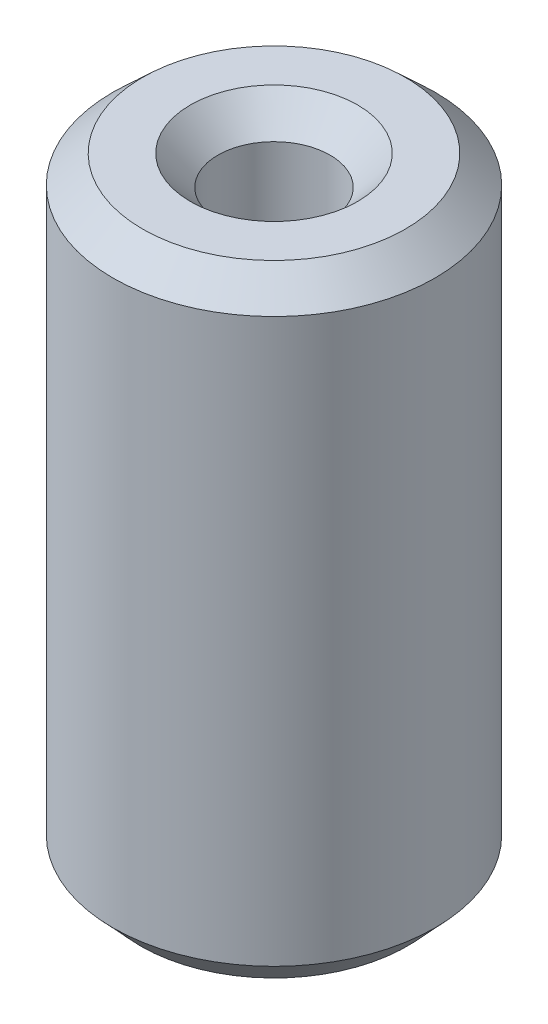
ISO-10303-21;
HEADER;
FILE_DESCRIPTION(('STEP AP214'),'2;1');
FILE_NAME('part.step','',(''),(''),'','','');
FILE_SCHEMA(('AUTOMOTIVE_DESIGN { 1 0 10303 214 1 1 1 1 }'));
ENDSEC;
DATA;
#1=APPLICATION_CONTEXT('core data for automotive mechanical design processes');
#2=APPLICATION_PROTOCOL_DEFINITION('international standard','automotive_design',2000,#1);
#3=PRODUCT_CONTEXT('',#1,'mechanical');
#4=PRODUCT('Part','Part','',(#3));
#5=PRODUCT_RELATED_PRODUCT_CATEGORY('part','',(#4));
#6=PRODUCT_DEFINITION_FORMATION('','',#4);
#7=PRODUCT_DEFINITION_CONTEXT('part definition',#1,'design');
#8=PRODUCT_DEFINITION('design','',#6,#7);
#9=PRODUCT_DEFINITION_SHAPE('','',#8);
#10=(LENGTH_UNIT() NAMED_UNIT(*) SI_UNIT(.MILLI.,.METRE.));
#11=(NAMED_UNIT(*) PLANE_ANGLE_UNIT() SI_UNIT($,.RADIAN.));
#12=(NAMED_UNIT(*) SI_UNIT($,.STERADIAN.) SOLID_ANGLE_UNIT());
#13=UNCERTAINTY_MEASURE_WITH_UNIT(LENGTH_MEASURE(1.E-05),#10,'distance_accuracy_value','');
#14=(GEOMETRIC_REPRESENTATION_CONTEXT(3) GLOBAL_UNCERTAINTY_ASSIGNED_CONTEXT((#13)) GLOBAL_UNIT_ASSIGNED_CONTEXT((#10,
#11,#12)) REPRESENTATION_CONTEXT('',''));
#15=CARTESIAN_POINT('',(0.,0.,0.));
#16=DIRECTION('',(0.,0.,1.));
#17=DIRECTION('',(1.,0.,0.));
#18=AXIS2_PLACEMENT_3D('',#15,#16,#17);
#19=CARTESIAN_POINT('',(0.,48.1296991277739,0.));
#20=DIRECTION('',(0.,-1.,0.));
#21=DIRECTION('',(0.,0.,-1.));
#22=AXIS2_PLACEMENT_3D('',#19,#20,#21);
#23=CYLINDRICAL_SURFACE('',#22,12.5);
#24=CARTESIAN_POINT('',(0.,2.29818482325118,0.));
#25=DIRECTION('',(0.,1.,0.));
#26=DIRECTION('',(0.,0.,1.));
#27=AXIS2_PLACEMENT_3D('',#24,#25,#26);
#28=CIRCLE('',#27,12.5);
#29=CARTESIAN_POINT('',(0.,2.29818482325118,12.5));
#30=VERTEX_POINT('',#29);
#31=EDGE_CURVE('E10',#30,#30,#28,.T.);
#32=ORIENTED_EDGE('',*,*,#31,.T.);
#33=EDGE_LOOP('',(#32));
#34=FACE_BOUND('',#33,.T.);
#35=CARTESIAN_POINT('',(0.,45.9868929971952,0.));
#36=DIRECTION('',(0.,1.,0.));
#37=DIRECTION('',(0.,0.,1.));
#38=AXIS2_PLACEMENT_3D('',#35,#36,#37);
#39=CIRCLE('',#38,12.5);
#40=CARTESIAN_POINT('',(0.,45.9868929971952,12.5));
#41=VERTEX_POINT('',#40);
#42=EDGE_CURVE('E50',#41,#41,#39,.F.);
#43=ORIENTED_EDGE('',*,*,#42,.T.);
#44=EDGE_LOOP('',(#43));
#45=FACE_BOUND('',#44,.T.);
#46=ADVANCED_FACE('F39',(#34,#45),#23,.T.);
#47=CARTESIAN_POINT('',(0.,48.1296991277739,0.));
#48=DIRECTION('',(0.,1.,0.));
#49=DIRECTION('',(0.,0.,1.));
#50=AXIS2_PLACEMENT_3D('',#47,#48,#49);
#51=PLANE('',#50);
#52=CARTESIAN_POINT('',(0.,48.1296991277739,0.));
#53=DIRECTION('',(0.,1.,0.));
#54=DIRECTION('',(0.,0.,1.));
#55=AXIS2_PLACEMENT_3D('',#52,#53,#54);
#56=CIRCLE('',#55,6.49425256324005);
#57=CARTESIAN_POINT('',(0.,48.1296991277739,6.49425256324005));
#58=VERTEX_POINT('',#57);
#59=EDGE_CURVE('E58',#58,#58,#56,.F.);
#60=ORIENTED_EDGE('',*,*,#59,.T.);
#61=EDGE_LOOP('',(#60));
#62=FACE_BOUND('',#61,.T.);
#63=CARTESIAN_POINT('',(0.,48.1296991277739,0.));
#64=DIRECTION('',(0.,1.,0.));
#65=DIRECTION('',(0.,0.,1.));
#66=AXIS2_PLACEMENT_3D('',#63,#64,#65);
#67=CIRCLE('',#66,10.2018151767488);
#68=CARTESIAN_POINT('',(0.,48.1296991277739,10.2018151767488));
#69=VERTEX_POINT('',#68);
#70=EDGE_CURVE('E61',#69,#69,#67,.T.);
#71=ORIENTED_EDGE('',*,*,#70,.T.);
#72=EDGE_LOOP('',(#71));
#73=FACE_BOUND('',#72,.T.);
#74=ADVANCED_FACE('F88',(#62,#73),#51,.T.);
#75=CARTESIAN_POINT('',(0.,0.,0.));
#76=DIRECTION('',(0.,1.,0.));
#77=DIRECTION('',(0.,0.,1.));
#78=AXIS2_PLACEMENT_3D('',#75,#76,#77);
#79=PLANE('',#78);
#80=CARTESIAN_POINT('',(0.,0.,0.));
#81=DIRECTION('',(0.,1.,0.));
#82=DIRECTION('',(0.,0.,1.));
#83=AXIS2_PLACEMENT_3D('',#80,#81,#82);
#84=CIRCLE('',#83,6.64963125591254);
#85=CARTESIAN_POINT('',(0.,0.,6.64963125591254));
#86=VERTEX_POINT('',#85);
#87=EDGE_CURVE('E51',#86,#86,#84,.T.);
#88=ORIENTED_EDGE('',*,*,#87,.T.);
#89=EDGE_LOOP('',(#88));
#90=FACE_BOUND('',#89,.T.);
#91=CARTESIAN_POINT('',(0.,0.,0.));
#92=DIRECTION('',(0.,1.,0.));
#93=DIRECTION('',(0.,0.,1.));
#94=AXIS2_PLACEMENT_3D('',#91,#92,#93);
#95=CIRCLE('',#94,10.3571938694213);
#96=CARTESIAN_POINT('',(0.,0.,10.3571938694213));
#97=VERTEX_POINT('',#96);
#98=EDGE_CURVE('E54',#97,#97,#95,.F.);
#99=ORIENTED_EDGE('',*,*,#98,.T.);
#100=EDGE_LOOP('',(#99));
#101=FACE_BOUND('',#100,.T.);
#102=ADVANCED_FACE('F83',(#90,#101),#79,.F.);
#103=CARTESIAN_POINT('',(0.,48.1296991277739,0.));
#104=DIRECTION('',(0.,-1.,0.));
#105=DIRECTION('',(0.,0.,-1.));
#106=AXIS2_PLACEMENT_3D('',#103,#104,#105);
#107=CYLINDRICAL_SURFACE('',#106,4.35144643266136);
#108=CARTESIAN_POINT('',(0.,45.8315143045227,0.));
#109=DIRECTION('',(0.,1.,0.));
#110=DIRECTION('',(0.,0.,1.));
#111=AXIS2_PLACEMENT_3D('',#108,#109,#110);
#112=CIRCLE('',#111,4.35144643266136);
#113=CARTESIAN_POINT('',(0.,45.8315143045227,4.35144643266136));
#114=VERTEX_POINT('',#113);
#115=EDGE_CURVE('E67',#114,#114,#112,.T.);
#116=ORIENTED_EDGE('',*,*,#115,.T.);
#117=EDGE_LOOP('',(#116));
#118=FACE_BOUND('',#117,.T.);
#119=CARTESIAN_POINT('',(0.,2.14280613057869,0.));
#120=DIRECTION('',(0.,1.,0.));
#121=DIRECTION('',(0.,0.,1.));
#122=AXIS2_PLACEMENT_3D('',#119,#120,#121);
#123=CIRCLE('',#122,4.35144643266136);
#124=CARTESIAN_POINT('',(0.,2.14280613057869,4.35144643266136));
#125=VERTEX_POINT('',#124);
#126=EDGE_CURVE('E69',#125,#125,#123,.F.);
#127=ORIENTED_EDGE('',*,*,#126,.T.);
#128=EDGE_LOOP('',(#127));
#129=FACE_BOUND('',#128,.T.);
#130=ADVANCED_FACE('F71',(#118,#129),#107,.F.);
#131=CARTESIAN_POINT('',(0.,45.8315143045227,0.));
#132=DIRECTION('',(0.,1.,0.));
#133=DIRECTION('',(0.,0.,1.));
#134=AXIS2_PLACEMENT_3D('',#131,#132,#133);
#135=CONICAL_SURFACE('',#134,4.35144643266136,0.750425036855662);
#136=ORIENTED_EDGE('',*,*,#59,.F.);
#137=EDGE_LOOP('',(#136));
#138=FACE_BOUND('',#137,.T.);
#139=ORIENTED_EDGE('',*,*,#115,.F.);
#140=EDGE_LOOP('',(#139));
#141=FACE_BOUND('',#140,.T.);
#142=ADVANCED_FACE('F77',(#138,#141),#135,.F.);
#143=CARTESIAN_POINT('',(0.,0.,0.));
#144=DIRECTION('',(0.,-1.,0.));
#145=DIRECTION('',(0.,0.,-1.));
#146=AXIS2_PLACEMENT_3D('',#143,#144,#145);
#147=CONICAL_SURFACE('',#146,6.64963125591254,0.820371289939237);
#148=ORIENTED_EDGE('',*,*,#126,.F.);
#149=EDGE_LOOP('',(#148));
#150=FACE_BOUND('',#149,.T.);
#151=ORIENTED_EDGE('',*,*,#87,.F.);
#152=EDGE_LOOP('',(#151));
#153=FACE_BOUND('',#152,.T.);
#154=ADVANCED_FACE('F73',(#150,#153),#147,.F.);
#155=CARTESIAN_POINT('',(0.,2.29818482325118,0.));
#156=DIRECTION('',(0.,1.,0.));
#157=DIRECTION('',(0.,0.,1.));
#158=AXIS2_PLACEMENT_3D('',#155,#156,#157);
#159=CONICAL_SURFACE('',#158,12.5,0.750425036855661);
#160=ORIENTED_EDGE('',*,*,#98,.F.);
#161=EDGE_LOOP('',(#160));
#162=FACE_BOUND('',#161,.T.);
#163=ORIENTED_EDGE('',*,*,#31,.F.);
#164=EDGE_LOOP('',(#163));
#165=FACE_BOUND('',#164,.T.);
#166=ADVANCED_FACE('F76',(#162,#165),#159,.T.);
#167=CARTESIAN_POINT('',(0.,48.1296991277739,0.));
#168=DIRECTION('',(0.,-1.,0.));
#169=DIRECTION('',(0.,0.,-1.));
#170=AXIS2_PLACEMENT_3D('',#167,#168,#169);
#171=CONICAL_SURFACE('',#170,10.2018151767488,0.820371289939235);
#172=ORIENTED_EDGE('',*,*,#42,.F.);
#173=EDGE_LOOP('',(#172));
#174=FACE_BOUND('',#173,.T.);
#175=ORIENTED_EDGE('',*,*,#70,.F.);
#176=EDGE_LOOP('',(#175));
#177=FACE_BOUND('',#176,.T.);
#178=ADVANCED_FACE('F45',(#174,#177),#171,.T.);
#179=CLOSED_SHELL('',(#46,#74,#102,#130,#142,#154,#166,#178));
#180=MANIFOLD_SOLID_BREP('B2',#179);
#181=ADVANCED_BREP_SHAPE_REPRESENTATION('',(#18,#180),#14);
#182=SHAPE_DEFINITION_REPRESENTATION(#9,#181);
ENDSEC;
END-ISO-10303-21;
